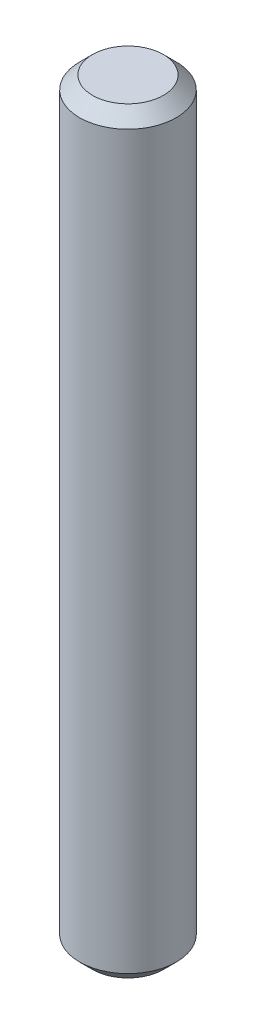
ISO-10303-21;
HEADER;
FILE_DESCRIPTION(('STEP AP214'),'2;1');
FILE_NAME('part.step','',(''),(''),'','','');
FILE_SCHEMA(('AUTOMOTIVE_DESIGN { 1 0 10303 214 1 1 1 1 }'));
ENDSEC;
DATA;
#1=APPLICATION_CONTEXT('core data for automotive mechanical design processes');
#2=APPLICATION_PROTOCOL_DEFINITION('international standard','automotive_design',2000,#1);
#3=PRODUCT_CONTEXT('',#1,'mechanical');
#4=PRODUCT('Part','Part','',(#3));
#5=PRODUCT_RELATED_PRODUCT_CATEGORY('part','',(#4));
#6=PRODUCT_DEFINITION_FORMATION('','',#4);
#7=PRODUCT_DEFINITION_CONTEXT('part definition',#1,'design');
#8=PRODUCT_DEFINITION('design','',#6,#7);
#9=PRODUCT_DEFINITION_SHAPE('','',#8);
#10=(LENGTH_UNIT() NAMED_UNIT(*) SI_UNIT(.MILLI.,.METRE.));
#11=(NAMED_UNIT(*) PLANE_ANGLE_UNIT() SI_UNIT($,.RADIAN.));
#12=(NAMED_UNIT(*) SI_UNIT($,.STERADIAN.) SOLID_ANGLE_UNIT());
#13=UNCERTAINTY_MEASURE_WITH_UNIT(LENGTH_MEASURE(1.E-05),#10,'distance_accuracy_value','');
#14=(GEOMETRIC_REPRESENTATION_CONTEXT(3) GLOBAL_UNCERTAINTY_ASSIGNED_CONTEXT((#13)) GLOBAL_UNIT_ASSIGNED_CONTEXT((#10,
#11,#12)) REPRESENTATION_CONTEXT('',''));
#15=CARTESIAN_POINT('',(0.,0.,0.));
#16=DIRECTION('',(0.,0.,1.));
#17=DIRECTION('',(1.,0.,0.));
#18=AXIS2_PLACEMENT_3D('',#15,#16,#17);
#19=CARTESIAN_POINT('',(0.,11.75,0.));
#20=DIRECTION('',(0.,-1.,0.));
#21=DIRECTION('',(0.,0.,-1.));
#22=AXIS2_PLACEMENT_3D('',#19,#20,#21);
#23=CYLINDRICAL_SURFACE('',#22,1.5);
#24=CARTESIAN_POINT('',(0.,-11.35,0.));
#25=DIRECTION('',(0.,1.,0.));
#26=DIRECTION('',(0.,0.,1.));
#27=AXIS2_PLACEMENT_3D('',#24,#25,#26);
#28=CIRCLE('',#27,1.5);
#29=CARTESIAN_POINT('',(0.,-11.35,1.5));
#30=VERTEX_POINT('',#29);
#31=EDGE_CURVE('E49',#30,#30,#28,.T.);
#32=ORIENTED_EDGE('',*,*,#31,.T.);
#33=EDGE_LOOP('',(#32));
#34=FACE_BOUND('',#33,.T.);
#35=CARTESIAN_POINT('',(0.,11.35,0.));
#36=DIRECTION('',(0.,1.,0.));
#37=DIRECTION('',(0.,0.,1.));
#38=AXIS2_PLACEMENT_3D('',#35,#36,#37);
#39=CIRCLE('',#38,1.5);
#40=CARTESIAN_POINT('',(0.,11.35,1.5));
#41=VERTEX_POINT('',#40);
#42=EDGE_CURVE('E53',#41,#41,#39,.F.);
#43=ORIENTED_EDGE('',*,*,#42,.T.);
#44=EDGE_LOOP('',(#43));
#45=FACE_BOUND('',#44,.T.);
#46=ADVANCED_FACE('F37',(#34,#45),#23,.T.);
#47=CARTESIAN_POINT('',(0.,11.75,0.));
#48=DIRECTION('',(0.,1.,0.));
#49=DIRECTION('',(0.,0.,1.));
#50=AXIS2_PLACEMENT_3D('',#47,#48,#49);
#51=PLANE('',#50);
#52=CARTESIAN_POINT('',(0.,11.75,0.));
#53=DIRECTION('',(0.,1.,0.));
#54=DIRECTION('',(0.,0.,1.));
#55=AXIS2_PLACEMENT_3D('',#52,#53,#54);
#56=CIRCLE('',#55,1.1);
#57=CARTESIAN_POINT('',(0.,11.75,1.1));
#58=VERTEX_POINT('',#57);
#59=EDGE_CURVE('E10',#58,#58,#56,.T.);
#60=ORIENTED_EDGE('',*,*,#59,.T.);
#61=EDGE_LOOP('',(#60));
#62=FACE_BOUND('',#61,.T.);
#63=ADVANCED_FACE('F69',(#62),#51,.T.);
#64=CARTESIAN_POINT('',(0.,-11.75,0.));
#65=DIRECTION('',(0.,1.,0.));
#66=DIRECTION('',(0.,0.,1.));
#67=AXIS2_PLACEMENT_3D('',#64,#65,#66);
#68=PLANE('',#67);
#69=CARTESIAN_POINT('',(0.,-11.75,0.));
#70=DIRECTION('',(0.,1.,0.));
#71=DIRECTION('',(0.,0.,1.));
#72=AXIS2_PLACEMENT_3D('',#69,#70,#71);
#73=CIRCLE('',#72,1.1);
#74=CARTESIAN_POINT('',(0.,-11.75,1.1));
#75=VERTEX_POINT('',#74);
#76=EDGE_CURVE('E45',#75,#75,#73,.F.);
#77=ORIENTED_EDGE('',*,*,#76,.T.);
#78=EDGE_LOOP('',(#77));
#79=FACE_BOUND('',#78,.T.);
#80=ADVANCED_FACE('F66',(#79),#68,.F.);
#81=CARTESIAN_POINT('',(0.,-11.35,0.));
#82=DIRECTION('',(0.,1.,0.));
#83=DIRECTION('',(0.,0.,1.));
#84=AXIS2_PLACEMENT_3D('',#81,#82,#83);
#85=CONICAL_SURFACE('',#84,1.5,0.785398163397455);
#86=ORIENTED_EDGE('',*,*,#76,.F.);
#87=EDGE_LOOP('',(#86));
#88=FACE_BOUND('',#87,.T.);
#89=ORIENTED_EDGE('',*,*,#31,.F.);
#90=EDGE_LOOP('',(#89));
#91=FACE_BOUND('',#90,.T.);
#92=ADVANCED_FACE('F62',(#88,#91),#85,.T.);
#93=CARTESIAN_POINT('',(0.,11.75,0.));
#94=DIRECTION('',(0.,-1.,0.));
#95=DIRECTION('',(0.,0.,-1.));
#96=AXIS2_PLACEMENT_3D('',#93,#94,#95);
#97=CONICAL_SURFACE('',#96,1.1,0.785398163397446);
#98=ORIENTED_EDGE('',*,*,#42,.F.);
#99=EDGE_LOOP('',(#98));
#100=FACE_BOUND('',#99,.T.);
#101=ORIENTED_EDGE('',*,*,#59,.F.);
#102=EDGE_LOOP('',(#101));
#103=FACE_BOUND('',#102,.T.);
#104=ADVANCED_FACE('F40',(#100,#103),#97,.T.);
#105=CLOSED_SHELL('',(#46,#63,#80,#92,#104));
#106=MANIFOLD_SOLID_BREP('B2',#105);
#107=ADVANCED_BREP_SHAPE_REPRESENTATION('',(#18,#106),#14);
#108=SHAPE_DEFINITION_REPRESENTATION(#9,#107);
ENDSEC;
END-ISO-10303-21;
